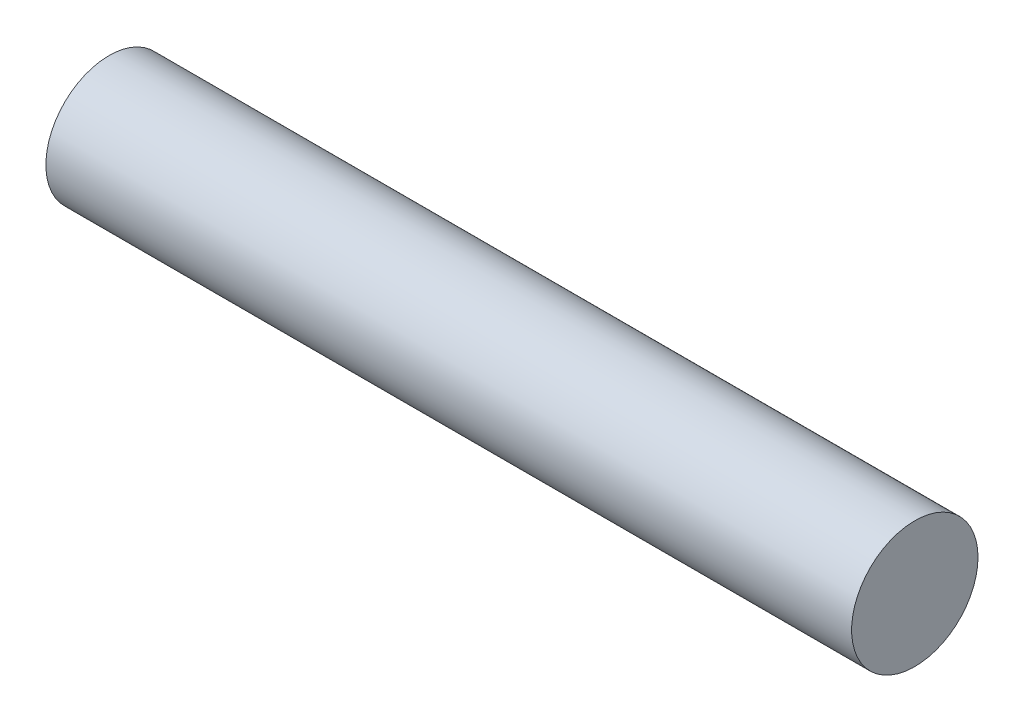
ISO-10303-21;
HEADER;
FILE_DESCRIPTION(('STEP AP214'),'2;1');
FILE_NAME('part.step','',(''),(''),'','','');
FILE_SCHEMA(('AUTOMOTIVE_DESIGN { 1 0 10303 214 1 1 1 1 }'));
ENDSEC;
DATA;
#1=APPLICATION_CONTEXT('core data for automotive mechanical design processes');
#2=APPLICATION_PROTOCOL_DEFINITION('international standard','automotive_design',2000,#1);
#3=PRODUCT_CONTEXT('',#1,'mechanical');
#4=PRODUCT('Part','Part','',(#3));
#5=PRODUCT_RELATED_PRODUCT_CATEGORY('part','',(#4));
#6=PRODUCT_DEFINITION_FORMATION('','',#4);
#7=PRODUCT_DEFINITION_CONTEXT('part definition',#1,'design');
#8=PRODUCT_DEFINITION('design','',#6,#7);
#9=PRODUCT_DEFINITION_SHAPE('','',#8);
#10=(LENGTH_UNIT() NAMED_UNIT(*) SI_UNIT(.MILLI.,.METRE.));
#11=(NAMED_UNIT(*) PLANE_ANGLE_UNIT() SI_UNIT($,.RADIAN.));
#12=(NAMED_UNIT(*) SI_UNIT($,.STERADIAN.) SOLID_ANGLE_UNIT());
#13=UNCERTAINTY_MEASURE_WITH_UNIT(LENGTH_MEASURE(1.E-05),#10,'distance_accuracy_value','');
#14=(GEOMETRIC_REPRESENTATION_CONTEXT(3) GLOBAL_UNCERTAINTY_ASSIGNED_CONTEXT((#13)) GLOBAL_UNIT_ASSIGNED_CONTEXT((#10,
#11,#12)) REPRESENTATION_CONTEXT('',''));
#15=CARTESIAN_POINT('',(0.,0.,0.));
#16=DIRECTION('',(0.,0.,1.));
#17=DIRECTION('',(1.,0.,0.));
#18=AXIS2_PLACEMENT_3D('',#15,#16,#17);
#19=CARTESIAN_POINT('',(80.9625,0.,0.));
#20=DIRECTION('',(-1.,0.,0.));
#21=DIRECTION('',(0.,0.,1.));
#22=AXIS2_PLACEMENT_3D('',#19,#20,#21);
#23=CYLINDRICAL_SURFACE('',#22,6.35);
#24=CARTESIAN_POINT('',(80.9625,0.,0.));
#25=DIRECTION('',(1.,0.,0.));
#26=DIRECTION('',(0.,0.,-1.));
#27=AXIS2_PLACEMENT_3D('',#24,#25,#26);
#28=CIRCLE('',#27,6.35);
#29=CARTESIAN_POINT('',(80.9625,0.,-6.35));
#30=VERTEX_POINT('',#29);
#31=EDGE_CURVE('E10',#30,#30,#28,.T.);
#32=ORIENTED_EDGE('',*,*,#31,.F.);
#33=EDGE_LOOP('',(#32));
#34=FACE_BOUND('',#33,.T.);
#35=CARTESIAN_POINT('',(0.,0.,0.));
#36=DIRECTION('',(1.,0.,0.));
#37=DIRECTION('',(0.,0.,-1.));
#38=AXIS2_PLACEMENT_3D('',#35,#36,#37);
#39=CIRCLE('',#38,6.35);
#40=CARTESIAN_POINT('',(0.,0.,-6.35));
#41=VERTEX_POINT('',#40);
#42=EDGE_CURVE('E33',#41,#41,#39,.T.);
#43=ORIENTED_EDGE('',*,*,#42,.T.);
#44=EDGE_LOOP('',(#43));
#45=FACE_BOUND('',#44,.T.);
#46=ADVANCED_FACE('F30',(#34,#45),#23,.T.);
#47=CARTESIAN_POINT('',(80.9625,0.,0.));
#48=DIRECTION('',(1.,0.,0.));
#49=DIRECTION('',(0.,0.,-1.));
#50=AXIS2_PLACEMENT_3D('',#47,#48,#49);
#51=PLANE('',#50);
#52=ORIENTED_EDGE('',*,*,#31,.T.);
#53=EDGE_LOOP('',(#52));
#54=FACE_BOUND('',#53,.T.);
#55=ADVANCED_FACE('F45',(#54),#51,.T.);
#56=CARTESIAN_POINT('',(0.,0.,0.));
#57=DIRECTION('',(1.,0.,0.));
#58=DIRECTION('',(0.,0.,-1.));
#59=AXIS2_PLACEMENT_3D('',#56,#57,#58);
#60=PLANE('',#59);
#61=ORIENTED_EDGE('',*,*,#42,.F.);
#62=EDGE_LOOP('',(#61));
#63=FACE_BOUND('',#62,.T.);
#64=ADVANCED_FACE('F43',(#63),#60,.F.);
#65=CLOSED_SHELL('',(#46,#55,#64));
#66=MANIFOLD_SOLID_BREP('B2',#65);
#67=ADVANCED_BREP_SHAPE_REPRESENTATION('',(#18,#66),#14);
#68=SHAPE_DEFINITION_REPRESENTATION(#9,#67);
ENDSEC;
END-ISO-10303-21;
